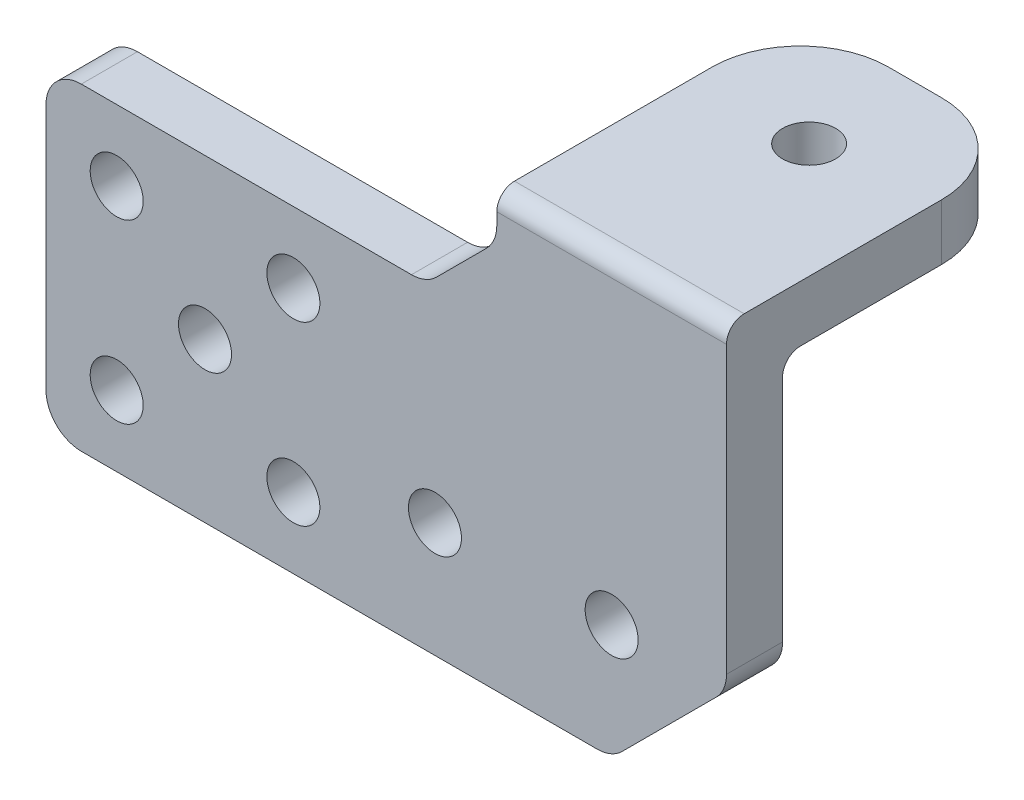
ISO-10303-21;
HEADER;
FILE_DESCRIPTION(('STEP AP214'),'2;1');
FILE_NAME('part.step','',(''),(''),'','','');
FILE_SCHEMA(('AUTOMOTIVE_DESIGN { 1 0 10303 214 1 1 1 1 }'));
ENDSEC;
DATA;
#1=APPLICATION_CONTEXT('core data for automotive mechanical design processes');
#2=APPLICATION_PROTOCOL_DEFINITION('international standard','automotive_design',2000,#1);
#3=PRODUCT_CONTEXT('',#1,'mechanical');
#4=PRODUCT('Part','Part','',(#3));
#5=PRODUCT_RELATED_PRODUCT_CATEGORY('part','',(#4));
#6=PRODUCT_DEFINITION_FORMATION('','',#4);
#7=PRODUCT_DEFINITION_CONTEXT('part definition',#1,'design');
#8=PRODUCT_DEFINITION('design','',#6,#7);
#9=PRODUCT_DEFINITION_SHAPE('','',#8);
#10=(LENGTH_UNIT() NAMED_UNIT(*) SI_UNIT(.MILLI.,.METRE.));
#11=(NAMED_UNIT(*) PLANE_ANGLE_UNIT() SI_UNIT($,.RADIAN.));
#12=(NAMED_UNIT(*) SI_UNIT($,.STERADIAN.) SOLID_ANGLE_UNIT());
#13=UNCERTAINTY_MEASURE_WITH_UNIT(LENGTH_MEASURE(1.E-05),#10,'distance_accuracy_value','');
#14=(GEOMETRIC_REPRESENTATION_CONTEXT(3) GLOBAL_UNCERTAINTY_ASSIGNED_CONTEXT((#13)) GLOBAL_UNIT_ASSIGNED_CONTEXT((#10,
#11,#12)) REPRESENTATION_CONTEXT('',''));
#15=CARTESIAN_POINT('',(0.,0.,0.));
#16=DIRECTION('',(0.,0.,1.));
#17=DIRECTION('',(1.,0.,0.));
#18=AXIS2_PLACEMENT_3D('',#15,#16,#17);
#19=CARTESIAN_POINT('',(6.5,0.,-3.175));
#20=DIRECTION('',(1.,0.,0.));
#21=DIRECTION('',(0.,0.,1.));
#22=AXIS2_PLACEMENT_3D('',#19,#20,#21);
#23=PLANE('',#22);
#24=DIRECTION('',(0.,-1.,0.));
#25=VECTOR('',#24,1.);
#26=CARTESIAN_POINT('',(6.5,0.,-3.175));
#27=LINE('',#26,#25);
#28=CARTESIAN_POINT('',(6.5,13.825,-3.175));
#29=VERTEX_POINT('',#28);
#30=CARTESIAN_POINT('',(6.5,0.82842712474619,-3.175));
#31=VERTEX_POINT('',#30);
#32=EDGE_CURVE('E323',#29,#31,#27,.T.);
#33=ORIENTED_EDGE('',*,*,#32,.F.);
#34=CARTESIAN_POINT('',(6.5,13.825,-4.175));
#35=DIRECTION('',(-1.,0.,0.));
#36=DIRECTION('',(0.,0.,1.));
#37=AXIS2_PLACEMENT_3D('',#34,#35,#36);
#38=CIRCLE('',#37,1.);
#39=CARTESIAN_POINT('',(6.5,14.825,-4.175));
#40=VERTEX_POINT('',#39);
#41=EDGE_CURVE('E230',#40,#29,#38,.F.);
#42=ORIENTED_EDGE('',*,*,#41,.F.);
#43=DIRECTION('',(0.,0.,1.));
#44=VECTOR('',#43,1.);
#45=CARTESIAN_POINT('',(6.5,14.825,-17.175));
#46=LINE('',#45,#44);
#47=CARTESIAN_POINT('',(6.5,14.825,-12.175));
#48=VERTEX_POINT('',#47);
#49=EDGE_CURVE('E357',#48,#40,#46,.T.);
#50=ORIENTED_EDGE('',*,*,#49,.F.);
#51=DIRECTION('',(0.,1.,0.));
#52=VECTOR('',#51,1.);
#53=CARTESIAN_POINT('',(6.5,0.,-12.175));
#54=LINE('',#53,#52);
#55=CARTESIAN_POINT('',(6.5,18.,-12.175));
#56=VERTEX_POINT('',#55);
#57=EDGE_CURVE('E212',#56,#48,#54,.F.);
#58=ORIENTED_EDGE('',*,*,#57,.F.);
#59=DIRECTION('',(0.,0.,1.));
#60=VECTOR('',#59,1.);
#61=CARTESIAN_POINT('',(6.5,18.,-3.175));
#62=LINE('',#61,#60);
#63=CARTESIAN_POINT('',(6.5,18.,-1.));
#64=VERTEX_POINT('',#63);
#65=EDGE_CURVE('E335',#56,#64,#62,.T.);
#66=ORIENTED_EDGE('',*,*,#65,.T.);
#67=CARTESIAN_POINT('',(6.5,17.,-1.));
#68=DIRECTION('',(-1.,0.,0.));
#69=DIRECTION('',(0.,0.,1.));
#70=AXIS2_PLACEMENT_3D('',#67,#68,#69);
#71=CIRCLE('',#70,1.);
#72=CARTESIAN_POINT('',(6.5,17.,0.));
#73=VERTEX_POINT('',#72);
#74=EDGE_CURVE('E217',#73,#64,#71,.T.);
#75=ORIENTED_EDGE('',*,*,#74,.F.);
#76=DIRECTION('',(0.,-1.,0.));
#77=VECTOR('',#76,1.);
#78=CARTESIAN_POINT('',(6.5,0.,0.));
#79=LINE('',#78,#77);
#80=CARTESIAN_POINT('',(6.5,0.82842712474619,0.));
#81=VERTEX_POINT('',#80);
#82=EDGE_CURVE('E344',#73,#81,#79,.T.);
#83=ORIENTED_EDGE('',*,*,#82,.T.);
#84=DIRECTION('',(0.,0.,1.));
#85=VECTOR('',#84,1.);
#86=CARTESIAN_POINT('',(6.5,0.82842712474619,0.));
#87=LINE('',#86,#85);
#88=EDGE_CURVE('E287',#31,#81,#87,.T.);
#89=ORIENTED_EDGE('',*,*,#88,.F.);
#90=EDGE_LOOP('',(#33,#42,#50,#58,#66,#75,#83,#89));
#91=FACE_BOUND('',#90,.T.);
#92=ADVANCED_FACE('F41',(#91),#23,.T.);
#93=CARTESIAN_POINT('',(0.,18.,-3.175));
#94=DIRECTION('',(0.,1.,0.));
#95=DIRECTION('',(0.,0.,-1.));
#96=AXIS2_PLACEMENT_3D('',#93,#94,#95);
#97=PLANE('',#96);
#98=CARTESIAN_POINT('',(0.,18.,-11.175));
#99=DIRECTION('',(0.,-1.,0.));
#100=DIRECTION('',(0.,0.,-1.));
#101=AXIS2_PLACEMENT_3D('',#98,#99,#100);
#102=CIRCLE('',#101,1.5);
#103=CARTESIAN_POINT('',(0.,18.,-12.675));
#104=VERTEX_POINT('',#103);
#105=EDGE_CURVE('E351',#104,#104,#102,.T.);
#106=ORIENTED_EDGE('',*,*,#105,.T.);
#107=EDGE_LOOP('',(#106));
#108=FACE_BOUND('',#107,.T.);
#109=ORIENTED_EDGE('',*,*,#65,.F.);
#110=CARTESIAN_POINT('',(1.5,18.,-12.175));
#111=DIRECTION('',(0.,-1.,0.));
#112=DIRECTION('',(0.,0.,-1.));
#113=AXIS2_PLACEMENT_3D('',#110,#111,#112);
#114=CIRCLE('',#113,5.);
#115=CARTESIAN_POINT('',(1.5,18.,-17.175));
#116=VERTEX_POINT('',#115);
#117=EDGE_CURVE('E206',#116,#56,#114,.T.);
#118=ORIENTED_EDGE('',*,*,#117,.F.);
#119=DIRECTION('',(-1.,0.,0.));
#120=VECTOR('',#119,1.);
#121=CARTESIAN_POINT('',(-6.5,18.,-17.175));
#122=LINE('',#121,#120);
#123=CARTESIAN_POINT('',(-1.5,18.,-17.175));
#124=VERTEX_POINT('',#123);
#125=EDGE_CURVE('E197',#116,#124,#122,.T.);
#126=ORIENTED_EDGE('',*,*,#125,.T.);
#127=CARTESIAN_POINT('',(-1.5,18.,-12.175));
#128=DIRECTION('',(0.,-1.,0.));
#129=DIRECTION('',(0.,0.,-1.));
#130=AXIS2_PLACEMENT_3D('',#127,#128,#129);
#131=CIRCLE('',#130,5.);
#132=CARTESIAN_POINT('',(-6.5,18.,-12.175));
#133=VERTEX_POINT('',#132);
#134=EDGE_CURVE('E185',#133,#124,#131,.T.);
#135=ORIENTED_EDGE('',*,*,#134,.F.);
#136=DIRECTION('',(0.,0.,1.));
#137=VECTOR('',#136,1.);
#138=CARTESIAN_POINT('',(-6.5,18.,-3.175));
#139=LINE('',#138,#137);
#140=CARTESIAN_POINT('',(-6.5,18.,-1.));
#141=VERTEX_POINT('',#140);
#142=EDGE_CURVE('E331',#133,#141,#139,.T.);
#143=ORIENTED_EDGE('',*,*,#142,.T.);
#144=DIRECTION('',(1.,0.,0.));
#145=VECTOR('',#144,1.);
#146=CARTESIAN_POINT('',(-6.5,18.,-1.));
#147=LINE('',#146,#145);
#148=EDGE_CURVE('E220',#64,#141,#147,.F.);
#149=ORIENTED_EDGE('',*,*,#148,.F.);
#150=EDGE_LOOP('',(#109,#118,#126,#135,#143,#149));
#151=FACE_BOUND('',#150,.T.);
#152=ADVANCED_FACE('F359',(#108,#151),#97,.T.);
#153=CARTESIAN_POINT('',(0.,0.,-3.175));
#154=DIRECTION('',(0.,0.,1.));
#155=DIRECTION('',(-1.,0.,0.));
#156=AXIS2_PLACEMENT_3D('',#153,#154,#155);
#157=CYLINDRICAL_SURFACE('',#156,1.5);
#158=CARTESIAN_POINT('',(0.,0.,-3.175));
#159=DIRECTION('',(0.,0.,1.));
#160=DIRECTION('',(1.,0.,0.));
#161=AXIS2_PLACEMENT_3D('',#158,#159,#160);
#162=CIRCLE('',#161,1.5);
#163=CARTESIAN_POINT('',(1.5,0.,-3.175));
#164=VERTEX_POINT('',#163);
#165=EDGE_CURVE('E332',#164,#164,#162,.T.);
#166=ORIENTED_EDGE('',*,*,#165,.F.);
#167=EDGE_LOOP('',(#166));
#168=FACE_BOUND('',#167,.T.);
#169=CARTESIAN_POINT('',(0.,0.,0.));
#170=DIRECTION('',(0.,0.,1.));
#171=DIRECTION('',(1.,0.,0.));
#172=AXIS2_PLACEMENT_3D('',#169,#170,#171);
#173=CIRCLE('',#172,1.5);
#174=CARTESIAN_POINT('',(1.5,0.,0.));
#175=VERTEX_POINT('',#174);
#176=EDGE_CURVE('E341',#175,#175,#173,.T.);
#177=ORIENTED_EDGE('',*,*,#176,.T.);
#178=EDGE_LOOP('',(#177));
#179=FACE_BOUND('',#178,.T.);
#180=ADVANCED_FACE('F450',(#168,#179),#157,.F.);
#181=CARTESIAN_POINT('',(-6.5,0.,-3.175));
#182=DIRECTION('',(-1.,0.,0.));
#183=DIRECTION('',(0.,0.,-1.));
#184=AXIS2_PLACEMENT_3D('',#181,#182,#183);
#185=PLANE('',#184);
#186=DIRECTION('',(0.,1.,0.));
#187=VECTOR('',#186,1.);
#188=CARTESIAN_POINT('',(-6.5,0.,0.));
#189=LINE('',#188,#187);
#190=CARTESIAN_POINT('',(-6.5,16.3284271247462,0.));
#191=VERTEX_POINT('',#190);
#192=CARTESIAN_POINT('',(-6.5,17.,0.));
#193=VERTEX_POINT('',#192);
#194=EDGE_CURVE('E317',#191,#193,#189,.T.);
#195=ORIENTED_EDGE('',*,*,#194,.T.);
#196=CARTESIAN_POINT('',(-6.5,17.,-1.));
#197=DIRECTION('',(1.,0.,0.));
#198=DIRECTION('',(0.,0.,-1.));
#199=AXIS2_PLACEMENT_3D('',#196,#197,#198);
#200=CIRCLE('',#199,1.);
#201=EDGE_CURVE('E223',#141,#193,#200,.T.);
#202=ORIENTED_EDGE('',*,*,#201,.F.);
#203=ORIENTED_EDGE('',*,*,#142,.F.);
#204=DIRECTION('',(0.,-1.,0.));
#205=VECTOR('',#204,1.);
#206=CARTESIAN_POINT('',(-6.5,0.,-12.175));
#207=LINE('',#206,#205);
#208=CARTESIAN_POINT('',(-6.5,14.825,-12.175));
#209=VERTEX_POINT('',#208);
#210=EDGE_CURVE('E204',#209,#133,#207,.F.);
#211=ORIENTED_EDGE('',*,*,#210,.F.);
#212=DIRECTION('',(0.,0.,1.));
#213=VECTOR('',#212,1.);
#214=CARTESIAN_POINT('',(-6.5,14.825,-17.175));
#215=LINE('',#214,#213);
#216=CARTESIAN_POINT('',(-6.5,14.825,-4.175));
#217=VERTEX_POINT('',#216);
#218=EDGE_CURVE('E202',#209,#217,#215,.T.);
#219=ORIENTED_EDGE('',*,*,#218,.T.);
#220=CARTESIAN_POINT('',(-6.5,13.825,-4.175));
#221=DIRECTION('',(1.,0.,0.));
#222=DIRECTION('',(0.,0.,-1.));
#223=AXIS2_PLACEMENT_3D('',#220,#221,#222);
#224=CIRCLE('',#223,1.);
#225=CARTESIAN_POINT('',(-6.5,13.825,-3.175));
#226=VERTEX_POINT('',#225);
#227=EDGE_CURVE('E233',#226,#217,#224,.F.);
#228=ORIENTED_EDGE('',*,*,#227,.F.);
#229=DIRECTION('',(0.,-1.,0.));
#230=VECTOR('',#229,1.);
#231=CARTESIAN_POINT('',(-6.5,0.,-3.175));
#232=LINE('',#231,#230);
#233=CARTESIAN_POINT('',(-6.5,16.3284271247462,-3.175));
#234=VERTEX_POINT('',#233);
#235=EDGE_CURVE('E236',#234,#226,#232,.T.);
#236=ORIENTED_EDGE('',*,*,#235,.F.);
#237=DIRECTION('',(0.,0.,1.));
#238=VECTOR('',#237,1.);
#239=CARTESIAN_POINT('',(-6.5,16.3284271247462,-3.175));
#240=LINE('',#239,#238);
#241=EDGE_CURVE('E271',#191,#234,#240,.F.);
#242=ORIENTED_EDGE('',*,*,#241,.F.);
#243=EDGE_LOOP('',(#195,#202,#203,#211,#219,#228,#236,#242));
#244=FACE_BOUND('',#243,.T.);
#245=ADVANCED_FACE('F319',(#244),#185,.T.);
#246=CARTESIAN_POINT('',(0.,0.,-3.175));
#247=DIRECTION('',(0.,0.,-1.));
#248=DIRECTION('',(1.,0.,0.));
#249=AXIS2_PLACEMENT_3D('',#246,#247,#248);
#250=PLANE('',#249);
#251=DIRECTION('',(-1.,0.,0.));
#252=VECTOR('',#251,1.);
#253=CARTESIAN_POINT('',(0.,-6.5,-3.175));
#254=LINE('',#253,#252);
#255=CARTESIAN_POINT('',(-0.82842712474619,-6.5,-3.175));
#256=VERTEX_POINT('',#255);
#257=CARTESIAN_POINT('',(-30.0129229130922,-6.5,-3.175));
#258=VERTEX_POINT('',#257);
#259=EDGE_CURVE('E367',#256,#258,#254,.T.);
#260=ORIENTED_EDGE('',*,*,#259,.T.);
#261=CARTESIAN_POINT('',(-30.0129229130922,-4.5,-3.175));
#262=DIRECTION('',(0.,0.,1.));
#263=DIRECTION('',(1.,0.,0.));
#264=AXIS2_PLACEMENT_3D('',#261,#262,#263);
#265=CIRCLE('',#264,2.);
#266=CARTESIAN_POINT('',(-32.0129229130922,-4.5,-3.175));
#267=VERTEX_POINT('',#266);
#268=EDGE_CURVE('E260',#267,#258,#265,.T.);
#269=ORIENTED_EDGE('',*,*,#268,.F.);
#270=DIRECTION('',(0.,1.,0.));
#271=VECTOR('',#270,1.);
#272=CARTESIAN_POINT('',(-32.0129229130922,0.,-3.175));
#273=LINE('',#272,#271);
#274=CARTESIAN_POINT('',(-32.0129229130922,9.50000000000003,-3.175));
#275=VERTEX_POINT('',#274);
#276=EDGE_CURVE('E381',#267,#275,#273,.T.);
#277=ORIENTED_EDGE('',*,*,#276,.T.);
#278=CARTESIAN_POINT('',(-30.0129229130922,9.50000000000003,-3.175));
#279=DIRECTION('',(0.,0.,1.));
#280=DIRECTION('',(1.,0.,0.));
#281=AXIS2_PLACEMENT_3D('',#278,#279,#280);
#282=CIRCLE('',#281,2.);
#283=CARTESIAN_POINT('',(-30.0129229130922,11.5,-3.175));
#284=VERTEX_POINT('',#283);
#285=EDGE_CURVE('E257',#284,#275,#282,.T.);
#286=ORIENTED_EDGE('',*,*,#285,.F.);
#287=DIRECTION('',(1.,0.,0.));
#288=VECTOR('',#287,1.);
#289=CARTESIAN_POINT('',(0.,11.5,-3.175));
#290=LINE('',#289,#288);
#291=CARTESIAN_POINT('',(-11.3284271247462,11.5,-3.175));
#292=VERTEX_POINT('',#291);
#293=EDGE_CURVE('E370',#284,#292,#290,.T.);
#294=ORIENTED_EDGE('',*,*,#293,.T.);
#295=CARTESIAN_POINT('',(-11.3284271247462,13.5,-3.175));
#296=DIRECTION('',(0.,0.,1.));
#297=DIRECTION('',(1.,0.,0.));
#298=AXIS2_PLACEMENT_3D('',#295,#296,#297);
#299=CIRCLE('',#298,2.);
#300=CARTESIAN_POINT('',(-9.91421356237311,12.0857864376269,-3.175));
#301=VERTEX_POINT('',#300);
#302=EDGE_CURVE('E292',#301,#292,#299,.F.);
#303=ORIENTED_EDGE('',*,*,#302,.F.);
#304=DIRECTION('',(0.707106781186551,0.707106781186544,0.));
#305=VECTOR('',#304,1.);
#306=CARTESIAN_POINT('',(-10.5,11.5,-3.175));
#307=LINE('',#306,#305);
#308=CARTESIAN_POINT('',(-7.08578643762691,14.9142135623731,-3.175));
#309=VERTEX_POINT('',#308);
#310=EDGE_CURVE('E242',#309,#301,#307,.F.);
#311=ORIENTED_EDGE('',*,*,#310,.F.);
#312=CARTESIAN_POINT('',(-8.5,16.3284271247462,-3.175));
#313=DIRECTION('',(0.,0.,1.));
#314=DIRECTION('',(1.,0.,0.));
#315=AXIS2_PLACEMENT_3D('',#312,#313,#314);
#316=CIRCLE('',#315,2.);
#317=EDGE_CURVE('E49',#234,#309,#316,.F.);
#318=ORIENTED_EDGE('',*,*,#317,.F.);
#319=ORIENTED_EDGE('',*,*,#235,.T.);
#320=DIRECTION('',(1.,0.,0.));
#321=VECTOR('',#320,1.);
#322=CARTESIAN_POINT('',(0.,13.825,-3.175));
#323=LINE('',#322,#321);
#324=EDGE_CURVE('E228',#29,#226,#323,.F.);
#325=ORIENTED_EDGE('',*,*,#324,.F.);
#326=ORIENTED_EDGE('',*,*,#32,.T.);
#327=CARTESIAN_POINT('',(4.5,0.82842712474619,-3.175));
#328=DIRECTION('',(0.,0.,1.));
#329=DIRECTION('',(1.,0.,0.));
#330=AXIS2_PLACEMENT_3D('',#327,#328,#329);
#331=CIRCLE('',#330,2.);
#332=CARTESIAN_POINT('',(5.9142135623731,-0.585786437626904,-3.175));
#333=VERTEX_POINT('',#332);
#334=EDGE_CURVE('E56',#333,#31,#331,.T.);
#335=ORIENTED_EDGE('',*,*,#334,.F.);
#336=DIRECTION('',(-0.707106781186548,-0.707106781186548,0.));
#337=VECTOR('',#336,1.);
#338=CARTESIAN_POINT('',(3.25,-3.25,-3.175));
#339=LINE('',#338,#337);
#340=CARTESIAN_POINT('',(0.585786437626904,-5.9142135623731,-3.175));
#341=VERTEX_POINT('',#340);
#342=EDGE_CURVE('E399',#333,#341,#339,.T.);
#343=ORIENTED_EDGE('',*,*,#342,.T.);
#344=CARTESIAN_POINT('',(-0.82842712474619,-4.5,-3.175));
#345=DIRECTION('',(0.,0.,1.));
#346=DIRECTION('',(1.,0.,0.));
#347=AXIS2_PLACEMENT_3D('',#344,#345,#346);
#348=CIRCLE('',#347,2.);
#349=EDGE_CURVE('E285',#256,#341,#348,.T.);
#350=ORIENTED_EDGE('',*,*,#349,.F.);
#351=EDGE_LOOP('',(#260,#269,#277,#286,#294,#303,#311,#318,#319,#325,#326,#335,#343,#350));
#352=FACE_BOUND('',#351,.T.);
#353=CARTESIAN_POINT('',(-28.0129229130922,7.50000000000006,-3.175));
#354=DIRECTION('',(0.,0.,-1.));
#355=DIRECTION('',(-1.,0.,0.));
#356=AXIS2_PLACEMENT_3D('',#353,#354,#355);
#357=CIRCLE('',#356,1.50000000000011);
#358=CARTESIAN_POINT('',(-29.5129229130923,7.50000000000006,-3.175));
#359=VERTEX_POINT('',#358);
#360=EDGE_CURVE('E398',#359,#359,#357,.T.);
#361=ORIENTED_EDGE('',*,*,#360,.F.);
#362=EDGE_LOOP('',(#361));
#363=FACE_BOUND('',#362,.T.);
#364=CARTESIAN_POINT('',(-28.0129229130922,-2.49999999999994,-3.175));
#365=DIRECTION('',(0.,0.,-1.));
#366=DIRECTION('',(-1.,0.,0.));
#367=AXIS2_PLACEMENT_3D('',#364,#365,#366);
#368=CIRCLE('',#367,1.50000000000011);
#369=CARTESIAN_POINT('',(-29.5129229130923,-2.49999999999994,-3.175));
#370=VERTEX_POINT('',#369);
#371=EDGE_CURVE('E405',#370,#370,#368,.T.);
#372=ORIENTED_EDGE('',*,*,#371,.F.);
#373=EDGE_LOOP('',(#372));
#374=FACE_BOUND('',#373,.T.);
#375=CARTESIAN_POINT('',(-18.0129229130922,-2.49999999999994,-3.175));
#376=DIRECTION('',(0.,0.,-1.));
#377=DIRECTION('',(-1.,0.,0.));
#378=AXIS2_PLACEMENT_3D('',#375,#376,#377);
#379=CIRCLE('',#378,1.5000000000001);
#380=CARTESIAN_POINT('',(-19.5129229130923,-2.49999999999994,-3.175));
#381=VERTEX_POINT('',#380);
#382=EDGE_CURVE('E411',#381,#381,#379,.T.);
#383=ORIENTED_EDGE('',*,*,#382,.F.);
#384=EDGE_LOOP('',(#383));
#385=FACE_BOUND('',#384,.T.);
#386=CARTESIAN_POINT('',(-23.0129229130923,2.50000000000004,-3.175));
#387=DIRECTION('',(0.,0.,-1.));
#388=DIRECTION('',(-1.,0.,0.));
#389=AXIS2_PLACEMENT_3D('',#386,#387,#388);
#390=CIRCLE('',#389,1.5);
#391=CARTESIAN_POINT('',(-24.5129229130923,2.50000000000004,-3.175));
#392=VERTEX_POINT('',#391);
#393=EDGE_CURVE('E392',#392,#392,#390,.T.);
#394=ORIENTED_EDGE('',*,*,#393,.F.);
#395=EDGE_LOOP('',(#394));
#396=FACE_BOUND('',#395,.T.);
#397=CARTESIAN_POINT('',(-18.0129229130922,7.50000000000006,-3.175));
#398=DIRECTION('',(0.,0.,-1.));
#399=DIRECTION('',(-1.,0.,0.));
#400=AXIS2_PLACEMENT_3D('',#397,#398,#399);
#401=CIRCLE('',#400,1.50000000000011);
#402=CARTESIAN_POINT('',(-19.5129229130923,7.50000000000006,-3.175));
#403=VERTEX_POINT('',#402);
#404=EDGE_CURVE('E385',#403,#403,#401,.T.);
#405=ORIENTED_EDGE('',*,*,#404,.F.);
#406=EDGE_LOOP('',(#405));
#407=FACE_BOUND('',#406,.T.);
#408=ORIENTED_EDGE('',*,*,#165,.T.);
#409=EDGE_LOOP('',(#408));
#410=FACE_BOUND('',#409,.T.);
#411=CARTESIAN_POINT('',(-10.,0.,-3.175));
#412=DIRECTION('',(0.,0.,1.));
#413=DIRECTION('',(1.,0.,0.));
#414=AXIS2_PLACEMENT_3D('',#411,#412,#413);
#415=CIRCLE('',#414,1.5);
#416=CARTESIAN_POINT('',(-8.5,0.,-3.175));
#417=VERTEX_POINT('',#416);
#418=EDGE_CURVE('E366',#417,#417,#415,.F.);
#419=ORIENTED_EDGE('',*,*,#418,.F.);
#420=EDGE_LOOP('',(#419));
#421=FACE_BOUND('',#420,.T.);
#422=ADVANCED_FACE('F303',(#352,#363,#374,#385,#396,#407,#410,#421),#250,.T.);
#423=CARTESIAN_POINT('',(0.,0.,0.));
#424=DIRECTION('',(0.,0.,-1.));
#425=DIRECTION('',(1.,0.,0.));
#426=AXIS2_PLACEMENT_3D('',#423,#424,#425);
#427=PLANE('',#426);
#428=CARTESIAN_POINT('',(-28.0129229130922,7.50000000000006,0.));
#429=DIRECTION('',(0.,0.,-1.));
#430=DIRECTION('',(-1.,0.,0.));
#431=AXIS2_PLACEMENT_3D('',#428,#429,#430);
#432=CIRCLE('',#431,1.50000000000011);
#433=CARTESIAN_POINT('',(-29.5129229130923,7.50000000000006,0.));
#434=VERTEX_POINT('',#433);
#435=EDGE_CURVE('E395',#434,#434,#432,.T.);
#436=ORIENTED_EDGE('',*,*,#435,.T.);
#437=EDGE_LOOP('',(#436));
#438=FACE_BOUND('',#437,.T.);
#439=CARTESIAN_POINT('',(-28.0129229130922,-2.49999999999994,0.));
#440=DIRECTION('',(0.,0.,-1.));
#441=DIRECTION('',(-1.,0.,0.));
#442=AXIS2_PLACEMENT_3D('',#439,#440,#441);
#443=CIRCLE('',#442,1.50000000000011);
#444=CARTESIAN_POINT('',(-29.5129229130923,-2.49999999999994,0.));
#445=VERTEX_POINT('',#444);
#446=EDGE_CURVE('E402',#445,#445,#443,.T.);
#447=ORIENTED_EDGE('',*,*,#446,.T.);
#448=EDGE_LOOP('',(#447));
#449=FACE_BOUND('',#448,.T.);
#450=CARTESIAN_POINT('',(-18.0129229130922,-2.49999999999994,0.));
#451=DIRECTION('',(0.,0.,-1.));
#452=DIRECTION('',(-1.,0.,0.));
#453=AXIS2_PLACEMENT_3D('',#450,#451,#452);
#454=CIRCLE('',#453,1.5000000000001);
#455=CARTESIAN_POINT('',(-19.5129229130923,-2.49999999999994,0.));
#456=VERTEX_POINT('',#455);
#457=EDGE_CURVE('E408',#456,#456,#454,.T.);
#458=ORIENTED_EDGE('',*,*,#457,.T.);
#459=EDGE_LOOP('',(#458));
#460=FACE_BOUND('',#459,.T.);
#461=CARTESIAN_POINT('',(-23.0129229130923,2.50000000000004,0.));
#462=DIRECTION('',(0.,0.,-1.));
#463=DIRECTION('',(-1.,0.,0.));
#464=AXIS2_PLACEMENT_3D('',#461,#462,#463);
#465=CIRCLE('',#464,1.5);
#466=CARTESIAN_POINT('',(-24.5129229130923,2.50000000000004,0.));
#467=VERTEX_POINT('',#466);
#468=EDGE_CURVE('E414',#467,#467,#465,.T.);
#469=ORIENTED_EDGE('',*,*,#468,.T.);
#470=EDGE_LOOP('',(#469));
#471=FACE_BOUND('',#470,.T.);
#472=CARTESIAN_POINT('',(-18.0129229130922,7.50000000000006,0.));
#473=DIRECTION('',(0.,0.,-1.));
#474=DIRECTION('',(-1.,0.,0.));
#475=AXIS2_PLACEMENT_3D('',#472,#473,#474);
#476=CIRCLE('',#475,1.50000000000011);
#477=CARTESIAN_POINT('',(-19.5129229130923,7.50000000000006,0.));
#478=VERTEX_POINT('',#477);
#479=EDGE_CURVE('E389',#478,#478,#476,.T.);
#480=ORIENTED_EDGE('',*,*,#479,.T.);
#481=EDGE_LOOP('',(#480));
#482=FACE_BOUND('',#481,.T.);
#483=DIRECTION('',(0.707106781186548,0.707106781186548,0.));
#484=VECTOR('',#483,1.);
#485=CARTESIAN_POINT('',(6.5,0.,0.));
#486=LINE('',#485,#484);
#487=CARTESIAN_POINT('',(0.585786437626904,-5.9142135623731,0.));
#488=VERTEX_POINT('',#487);
#489=CARTESIAN_POINT('',(5.9142135623731,-0.585786437626905,0.));
#490=VERTEX_POINT('',#489);
#491=EDGE_CURVE('E421',#488,#490,#486,.T.);
#492=ORIENTED_EDGE('',*,*,#491,.T.);
#493=CARTESIAN_POINT('',(4.5,0.82842712474619,0.));
#494=DIRECTION('',(0.,0.,1.));
#495=DIRECTION('',(1.,0.,0.));
#496=AXIS2_PLACEMENT_3D('',#493,#494,#495);
#497=CIRCLE('',#496,2.);
#498=EDGE_CURVE('E278',#81,#490,#497,.F.);
#499=ORIENTED_EDGE('',*,*,#498,.F.);
#500=ORIENTED_EDGE('',*,*,#82,.F.);
#501=DIRECTION('',(1.,0.,0.));
#502=VECTOR('',#501,1.);
#503=CARTESIAN_POINT('',(6.5,17.,0.));
#504=LINE('',#503,#502);
#505=EDGE_CURVE('E215',#193,#73,#504,.T.);
#506=ORIENTED_EDGE('',*,*,#505,.F.);
#507=ORIENTED_EDGE('',*,*,#194,.F.);
#508=CARTESIAN_POINT('',(-8.5,16.3284271247462,0.));
#509=DIRECTION('',(0.,0.,1.));
#510=DIRECTION('',(1.,0.,0.));
#511=AXIS2_PLACEMENT_3D('',#508,#509,#510);
#512=CIRCLE('',#511,2.);
#513=CARTESIAN_POINT('',(-7.08578643762691,14.9142135623731,0.));
#514=VERTEX_POINT('',#513);
#515=EDGE_CURVE('E11',#514,#191,#512,.T.);
#516=ORIENTED_EDGE('',*,*,#515,.F.);
#517=DIRECTION('',(-0.707106781186551,-0.707106781186544,0.));
#518=VECTOR('',#517,1.);
#519=CARTESIAN_POINT('',(-11.,11.0000000000001,0.));
#520=LINE('',#519,#518);
#521=CARTESIAN_POINT('',(-9.91421356237312,12.0857864376269,0.));
#522=VERTEX_POINT('',#521);
#523=EDGE_CURVE('E239',#522,#514,#520,.F.);
#524=ORIENTED_EDGE('',*,*,#523,.F.);
#525=CARTESIAN_POINT('',(-11.3284271247462,13.5,0.));
#526=DIRECTION('',(0.,0.,1.));
#527=DIRECTION('',(1.,0.,0.));
#528=AXIS2_PLACEMENT_3D('',#525,#526,#527);
#529=CIRCLE('',#528,2.);
#530=CARTESIAN_POINT('',(-11.3284271247462,11.5,0.));
#531=VERTEX_POINT('',#530);
#532=EDGE_CURVE('E289',#531,#522,#529,.T.);
#533=ORIENTED_EDGE('',*,*,#532,.F.);
#534=DIRECTION('',(1.,0.,0.));
#535=VECTOR('',#534,1.);
#536=CARTESIAN_POINT('',(0.,11.5,0.));
#537=LINE('',#536,#535);
#538=CARTESIAN_POINT('',(-30.0129229130922,11.5,0.));
#539=VERTEX_POINT('',#538);
#540=EDGE_CURVE('E378',#539,#531,#537,.T.);
#541=ORIENTED_EDGE('',*,*,#540,.F.);
#542=CARTESIAN_POINT('',(-30.0129229130922,9.50000000000003,0.));
#543=DIRECTION('',(0.,0.,1.));
#544=DIRECTION('',(1.,0.,0.));
#545=AXIS2_PLACEMENT_3D('',#542,#543,#544);
#546=CIRCLE('',#545,2.);
#547=CARTESIAN_POINT('',(-32.0129229130922,9.50000000000003,0.));
#548=VERTEX_POINT('',#547);
#549=EDGE_CURVE('E247',#548,#539,#546,.F.);
#550=ORIENTED_EDGE('',*,*,#549,.F.);
#551=DIRECTION('',(0.,1.,0.));
#552=VECTOR('',#551,1.);
#553=CARTESIAN_POINT('',(-32.0129229130922,0.,0.));
#554=LINE('',#553,#552);
#555=CARTESIAN_POINT('',(-32.0129229130922,-4.5,0.));
#556=VERTEX_POINT('',#555);
#557=EDGE_CURVE('E382',#556,#548,#554,.T.);
#558=ORIENTED_EDGE('',*,*,#557,.F.);
#559=CARTESIAN_POINT('',(-30.0129229130922,-4.5,0.));
#560=DIRECTION('',(0.,0.,1.));
#561=DIRECTION('',(1.,0.,0.));
#562=AXIS2_PLACEMENT_3D('',#559,#560,#561);
#563=CIRCLE('',#562,2.);
#564=CARTESIAN_POINT('',(-30.0129229130922,-6.5,0.));
#565=VERTEX_POINT('',#564);
#566=EDGE_CURVE('E250',#565,#556,#563,.F.);
#567=ORIENTED_EDGE('',*,*,#566,.F.);
#568=DIRECTION('',(-1.,0.,0.));
#569=VECTOR('',#568,1.);
#570=CARTESIAN_POINT('',(0.,-6.5,0.));
#571=LINE('',#570,#569);
#572=CARTESIAN_POINT('',(-0.82842712474619,-6.5,0.));
#573=VERTEX_POINT('',#572);
#574=EDGE_CURVE('E373',#573,#565,#571,.T.);
#575=ORIENTED_EDGE('',*,*,#574,.F.);
#576=CARTESIAN_POINT('',(-0.82842712474619,-4.5,0.));
#577=DIRECTION('',(0.,0.,1.));
#578=DIRECTION('',(1.,0.,0.));
#579=AXIS2_PLACEMENT_3D('',#576,#577,#578);
#580=CIRCLE('',#579,2.);
#581=EDGE_CURVE('E281',#488,#573,#580,.F.);
#582=ORIENTED_EDGE('',*,*,#581,.F.);
#583=EDGE_LOOP('',(#492,#499,#500,#506,#507,#516,#524,#533,#541,#550,#558,#567,#575,#582));
#584=FACE_BOUND('',#583,.T.);
#585=CARTESIAN_POINT('',(-10.,0.,0.));
#586=DIRECTION('',(0.,0.,-1.));
#587=DIRECTION('',(-1.,0.,0.));
#588=AXIS2_PLACEMENT_3D('',#585,#586,#587);
#589=CIRCLE('',#588,1.5);
#590=CARTESIAN_POINT('',(-11.5,0.,0.));
#591=VERTEX_POINT('',#590);
#592=EDGE_CURVE('E369',#591,#591,#589,.T.);
#593=ORIENTED_EDGE('',*,*,#592,.T.);
#594=EDGE_LOOP('',(#593));
#595=FACE_BOUND('',#594,.T.);
#596=ORIENTED_EDGE('',*,*,#176,.F.);
#597=EDGE_LOOP('',(#596));
#598=FACE_BOUND('',#597,.T.);
#599=ADVANCED_FACE('F314',(#438,#449,#460,#471,#482,#584,#595,#598),#427,.F.);
#600=CARTESIAN_POINT('',(-6.5,14.825,-17.175));
#601=DIRECTION('',(0.,1.,0.));
#602=DIRECTION('',(0.,0.,-1.));
#603=AXIS2_PLACEMENT_3D('',#600,#601,#602);
#604=PLANE('',#603);
#605=CARTESIAN_POINT('',(0.,14.825,-11.175));
#606=DIRECTION('',(0.,-1.,0.));
#607=DIRECTION('',(0.,0.,-1.));
#608=AXIS2_PLACEMENT_3D('',#605,#606,#607);
#609=CIRCLE('',#608,1.5);
#610=CARTESIAN_POINT('',(0.,14.825,-12.675));
#611=VERTEX_POINT('',#610);
#612=EDGE_CURVE('E198',#611,#611,#609,.T.);
#613=ORIENTED_EDGE('',*,*,#612,.F.);
#614=EDGE_LOOP('',(#613));
#615=FACE_BOUND('',#614,.T.);
#616=ORIENTED_EDGE('',*,*,#218,.F.);
#617=CARTESIAN_POINT('',(-1.5,14.825,-12.175));
#618=DIRECTION('',(0.,-1.,0.));
#619=DIRECTION('',(0.,0.,-1.));
#620=AXIS2_PLACEMENT_3D('',#617,#618,#619);
#621=CIRCLE('',#620,5.);
#622=CARTESIAN_POINT('',(-1.5,14.825,-17.175));
#623=VERTEX_POINT('',#622);
#624=EDGE_CURVE('E182',#623,#209,#621,.F.);
#625=ORIENTED_EDGE('',*,*,#624,.F.);
#626=DIRECTION('',(1.,0.,0.));
#627=VECTOR('',#626,1.);
#628=CARTESIAN_POINT('',(-6.5,14.825,-17.175));
#629=LINE('',#628,#627);
#630=CARTESIAN_POINT('',(1.5,14.825,-17.175));
#631=VERTEX_POINT('',#630);
#632=EDGE_CURVE('E193',#623,#631,#629,.T.);
#633=ORIENTED_EDGE('',*,*,#632,.T.);
#634=CARTESIAN_POINT('',(1.5,14.825,-12.175));
#635=DIRECTION('',(0.,-1.,0.));
#636=DIRECTION('',(0.,0.,-1.));
#637=AXIS2_PLACEMENT_3D('',#634,#635,#636);
#638=CIRCLE('',#637,5.);
#639=EDGE_CURVE('E189',#48,#631,#638,.F.);
#640=ORIENTED_EDGE('',*,*,#639,.F.);
#641=ORIENTED_EDGE('',*,*,#49,.T.);
#642=DIRECTION('',(1.,0.,0.));
#643=VECTOR('',#642,1.);
#644=CARTESIAN_POINT('',(-6.5,14.825,-4.175));
#645=LINE('',#644,#643);
#646=EDGE_CURVE('E226',#217,#40,#645,.T.);
#647=ORIENTED_EDGE('',*,*,#646,.F.);
#648=EDGE_LOOP('',(#616,#625,#633,#640,#641,#647));
#649=FACE_BOUND('',#648,.T.);
#650=ADVANCED_FACE('F200',(#615,#649),#604,.F.);
#651=CARTESIAN_POINT('',(0.,0.,-17.175));
#652=DIRECTION('',(0.,0.,-1.));
#653=DIRECTION('',(1.,0.,0.));
#654=AXIS2_PLACEMENT_3D('',#651,#652,#653);
#655=PLANE('',#654);
#656=ORIENTED_EDGE('',*,*,#125,.F.);
#657=DIRECTION('',(0.,1.,0.));
#658=VECTOR('',#657,1.);
#659=CARTESIAN_POINT('',(1.5,0.,-17.175));
#660=LINE('',#659,#658);
#661=EDGE_CURVE('E190',#631,#116,#660,.T.);
#662=ORIENTED_EDGE('',*,*,#661,.F.);
#663=ORIENTED_EDGE('',*,*,#632,.F.);
#664=DIRECTION('',(0.,-1.,0.));
#665=VECTOR('',#664,1.);
#666=CARTESIAN_POINT('',(-1.5,0.,-17.175));
#667=LINE('',#666,#665);
#668=EDGE_CURVE('E178',#124,#623,#667,.T.);
#669=ORIENTED_EDGE('',*,*,#668,.F.);
#670=EDGE_LOOP('',(#656,#662,#663,#669));
#671=FACE_BOUND('',#670,.T.);
#672=ADVANCED_FACE('F194',(#671),#655,.T.);
#673=CARTESIAN_POINT('',(0.,0.,-11.175));
#674=DIRECTION('',(0.,1.,0.));
#675=DIRECTION('',(0.,0.,-1.));
#676=AXIS2_PLACEMENT_3D('',#673,#674,#675);
#677=CYLINDRICAL_SURFACE('',#676,1.5);
#678=ORIENTED_EDGE('',*,*,#105,.F.);
#679=EDGE_LOOP('',(#678));
#680=FACE_BOUND('',#679,.T.);
#681=ORIENTED_EDGE('',*,*,#612,.T.);
#682=EDGE_LOOP('',(#681));
#683=FACE_BOUND('',#682,.T.);
#684=ADVANCED_FACE('F459',(#680,#683),#677,.F.);
#685=CARTESIAN_POINT('',(-1.5,0.,-12.175));
#686=DIRECTION('',(0.,-1.,0.));
#687=DIRECTION('',(0.,0.,1.));
#688=AXIS2_PLACEMENT_3D('',#685,#686,#687);
#689=CYLINDRICAL_SURFACE('',#688,5.);
#690=ORIENTED_EDGE('',*,*,#134,.T.);
#691=ORIENTED_EDGE('',*,*,#668,.T.);
#692=ORIENTED_EDGE('',*,*,#624,.T.);
#693=ORIENTED_EDGE('',*,*,#210,.T.);
#694=EDGE_LOOP('',(#690,#691,#692,#693));
#695=FACE_BOUND('',#694,.T.);
#696=ADVANCED_FACE('F180',(#695),#689,.T.);
#697=CARTESIAN_POINT('',(1.5,0.,-12.175));
#698=DIRECTION('',(0.,1.,0.));
#699=DIRECTION('',(0.,0.,-1.));
#700=AXIS2_PLACEMENT_3D('',#697,#698,#699);
#701=CYLINDRICAL_SURFACE('',#700,5.);
#702=ORIENTED_EDGE('',*,*,#639,.T.);
#703=ORIENTED_EDGE('',*,*,#661,.T.);
#704=ORIENTED_EDGE('',*,*,#117,.T.);
#705=ORIENTED_EDGE('',*,*,#57,.T.);
#706=EDGE_LOOP('',(#702,#703,#704,#705));
#707=FACE_BOUND('',#706,.T.);
#708=ADVANCED_FACE('F353',(#707),#701,.T.);
#709=CARTESIAN_POINT('',(0.,-6.5,-24.1809515376));
#710=DIRECTION('',(0.,-1.,0.));
#711=DIRECTION('',(0.,0.,1.));
#712=AXIS2_PLACEMENT_3D('',#709,#710,#711);
#713=PLANE('',#712);
#714=ORIENTED_EDGE('',*,*,#574,.T.);
#715=DIRECTION('',(0.,0.,1.));
#716=VECTOR('',#715,1.);
#717=CARTESIAN_POINT('',(-30.0129229130922,-6.5,-24.1809515376));
#718=LINE('',#717,#716);
#719=EDGE_CURVE('E245',#258,#565,#718,.T.);
#720=ORIENTED_EDGE('',*,*,#719,.F.);
#721=ORIENTED_EDGE('',*,*,#259,.F.);
#722=DIRECTION('',(0.,0.,1.));
#723=VECTOR('',#722,1.);
#724=CARTESIAN_POINT('',(-0.82842712474619,-6.5,-3.175));
#725=LINE('',#724,#723);
#726=EDGE_CURVE('E64',#573,#256,#725,.F.);
#727=ORIENTED_EDGE('',*,*,#726,.F.);
#728=EDGE_LOOP('',(#714,#720,#721,#727));
#729=FACE_BOUND('',#728,.T.);
#730=ADVANCED_FACE('F441',(#729),#713,.T.);
#731=CARTESIAN_POINT('',(-10.,0.,-24.1809515376));
#732=DIRECTION('',(0.,0.,1.));
#733=DIRECTION('',(-1.,0.,0.));
#734=AXIS2_PLACEMENT_3D('',#731,#732,#733);
#735=CYLINDRICAL_SURFACE('',#734,1.5);
#736=ORIENTED_EDGE('',*,*,#592,.F.);
#737=EDGE_LOOP('',(#736));
#738=FACE_BOUND('',#737,.T.);
#739=ORIENTED_EDGE('',*,*,#418,.T.);
#740=EDGE_LOOP('',(#739));
#741=FACE_BOUND('',#740,.T.);
#742=ADVANCED_FACE('F433',(#738,#741),#735,.F.);
#743=CARTESIAN_POINT('',(0.,17.,-1.));
#744=DIRECTION('',(-1.,0.,0.));
#745=DIRECTION('',(0.,0.,-1.));
#746=AXIS2_PLACEMENT_3D('',#743,#744,#745);
#747=CYLINDRICAL_SURFACE('',#746,1.);
#748=ORIENTED_EDGE('',*,*,#201,.T.);
#749=ORIENTED_EDGE('',*,*,#505,.T.);
#750=ORIENTED_EDGE('',*,*,#74,.T.);
#751=ORIENTED_EDGE('',*,*,#148,.T.);
#752=EDGE_LOOP('',(#748,#749,#750,#751));
#753=FACE_BOUND('',#752,.T.);
#754=ADVANCED_FACE('F430',(#753),#747,.T.);
#755=CARTESIAN_POINT('',(-6.5,13.825,-4.175));
#756=DIRECTION('',(1.,0.,0.));
#757=DIRECTION('',(0.,0.,1.));
#758=AXIS2_PLACEMENT_3D('',#755,#756,#757);
#759=CYLINDRICAL_SURFACE('',#758,1.);
#760=ORIENTED_EDGE('',*,*,#227,.T.);
#761=ORIENTED_EDGE('',*,*,#646,.T.);
#762=ORIENTED_EDGE('',*,*,#41,.T.);
#763=ORIENTED_EDGE('',*,*,#324,.T.);
#764=EDGE_LOOP('',(#760,#761,#762,#763));
#765=FACE_BOUND('',#764,.T.);
#766=ADVANCED_FACE('F326',(#765),#759,.F.);
#767=CARTESIAN_POINT('',(0.,11.5,-3.175));
#768=DIRECTION('',(0.,1.,0.));
#769=DIRECTION('',(0.,0.,-1.));
#770=AXIS2_PLACEMENT_3D('',#767,#768,#769);
#771=PLANE('',#770);
#772=ORIENTED_EDGE('',*,*,#293,.F.);
#773=DIRECTION('',(0.,0.,1.));
#774=VECTOR('',#773,1.);
#775=CARTESIAN_POINT('',(-30.0129229130922,11.5,-3.175));
#776=LINE('',#775,#774);
#777=EDGE_CURVE('E263',#539,#284,#776,.F.);
#778=ORIENTED_EDGE('',*,*,#777,.F.);
#779=ORIENTED_EDGE('',*,*,#540,.T.);
#780=DIRECTION('',(0.,0.,-1.));
#781=VECTOR('',#780,1.);
#782=CARTESIAN_POINT('',(-11.3284271247462,11.5,-3.175));
#783=LINE('',#782,#781);
#784=EDGE_CURVE('E265',#292,#531,#783,.F.);
#785=ORIENTED_EDGE('',*,*,#784,.F.);
#786=EDGE_LOOP('',(#772,#778,#779,#785));
#787=FACE_BOUND('',#786,.T.);
#788=ADVANCED_FACE('F439',(#787),#771,.T.);
#789=CARTESIAN_POINT('',(-32.0129229130922,0.,-3.175));
#790=DIRECTION('',(-1.,0.,0.));
#791=DIRECTION('',(0.,0.,-1.));
#792=AXIS2_PLACEMENT_3D('',#789,#790,#791);
#793=PLANE('',#792);
#794=ORIENTED_EDGE('',*,*,#557,.T.);
#795=DIRECTION('',(0.,0.,1.));
#796=VECTOR('',#795,1.);
#797=CARTESIAN_POINT('',(-32.0129229130922,9.50000000000003,-3.175));
#798=LINE('',#797,#796);
#799=EDGE_CURVE('E253',#275,#548,#798,.T.);
#800=ORIENTED_EDGE('',*,*,#799,.F.);
#801=ORIENTED_EDGE('',*,*,#276,.F.);
#802=DIRECTION('',(0.,0.,1.));
#803=VECTOR('',#802,1.);
#804=CARTESIAN_POINT('',(-32.0129229130922,-4.5,-3.175));
#805=LINE('',#804,#803);
#806=EDGE_CURVE('E255',#556,#267,#805,.F.);
#807=ORIENTED_EDGE('',*,*,#806,.F.);
#808=EDGE_LOOP('',(#794,#800,#801,#807));
#809=FACE_BOUND('',#808,.T.);
#810=ADVANCED_FACE('F469',(#809),#793,.T.);
#811=CARTESIAN_POINT('',(-18.0129229130922,7.50000000000006,-3.175));
#812=DIRECTION('',(0.,0.,1.));
#813=DIRECTION('',(-1.,0.,0.));
#814=AXIS2_PLACEMENT_3D('',#811,#812,#813);
#815=CYLINDRICAL_SURFACE('',#814,1.50000000000011);
#816=ORIENTED_EDGE('',*,*,#404,.T.);
#817=EDGE_LOOP('',(#816));
#818=FACE_BOUND('',#817,.T.);
#819=ORIENTED_EDGE('',*,*,#479,.F.);
#820=EDGE_LOOP('',(#819));
#821=FACE_BOUND('',#820,.T.);
#822=ADVANCED_FACE('F557',(#818,#821),#815,.F.);
#823=CARTESIAN_POINT('',(-23.0129229130923,2.50000000000004,-3.175));
#824=DIRECTION('',(0.,0.,1.));
#825=DIRECTION('',(-1.,0.,0.));
#826=AXIS2_PLACEMENT_3D('',#823,#824,#825);
#827=CYLINDRICAL_SURFACE('',#826,1.5);
#828=ORIENTED_EDGE('',*,*,#393,.T.);
#829=EDGE_LOOP('',(#828));
#830=FACE_BOUND('',#829,.T.);
#831=ORIENTED_EDGE('',*,*,#468,.F.);
#832=EDGE_LOOP('',(#831));
#833=FACE_BOUND('',#832,.T.);
#834=ADVANCED_FACE('F566',(#830,#833),#827,.F.);
#835=CARTESIAN_POINT('',(-18.0129229130922,-2.49999999999994,-3.175));
#836=DIRECTION('',(0.,0.,1.));
#837=DIRECTION('',(-1.,0.,0.));
#838=AXIS2_PLACEMENT_3D('',#835,#836,#837);
#839=CYLINDRICAL_SURFACE('',#838,1.5000000000001);
#840=ORIENTED_EDGE('',*,*,#382,.T.);
#841=EDGE_LOOP('',(#840));
#842=FACE_BOUND('',#841,.T.);
#843=ORIENTED_EDGE('',*,*,#457,.F.);
#844=EDGE_LOOP('',(#843));
#845=FACE_BOUND('',#844,.T.);
#846=ADVANCED_FACE('F576',(#842,#845),#839,.F.);
#847=CARTESIAN_POINT('',(-28.0129229130922,-2.49999999999994,-3.175));
#848=DIRECTION('',(0.,0.,1.));
#849=DIRECTION('',(-1.,0.,0.));
#850=AXIS2_PLACEMENT_3D('',#847,#848,#849);
#851=CYLINDRICAL_SURFACE('',#850,1.50000000000011);
#852=ORIENTED_EDGE('',*,*,#371,.T.);
#853=EDGE_LOOP('',(#852));
#854=FACE_BOUND('',#853,.T.);
#855=ORIENTED_EDGE('',*,*,#446,.F.);
#856=EDGE_LOOP('',(#855));
#857=FACE_BOUND('',#856,.T.);
#858=ADVANCED_FACE('F586',(#854,#857),#851,.F.);
#859=CARTESIAN_POINT('',(-28.0129229130922,7.50000000000006,-3.175));
#860=DIRECTION('',(0.,0.,1.));
#861=DIRECTION('',(-1.,0.,0.));
#862=AXIS2_PLACEMENT_3D('',#859,#860,#861);
#863=CYLINDRICAL_SURFACE('',#862,1.50000000000011);
#864=ORIENTED_EDGE('',*,*,#360,.T.);
#865=EDGE_LOOP('',(#864));
#866=FACE_BOUND('',#865,.T.);
#867=ORIENTED_EDGE('',*,*,#435,.F.);
#868=EDGE_LOOP('',(#867));
#869=FACE_BOUND('',#868,.T.);
#870=ADVANCED_FACE('F596',(#866,#869),#863,.F.);
#871=CARTESIAN_POINT('',(-10.5,11.5,-3.175));
#872=DIRECTION('',(-0.707106781186544,0.707106781186551,0.));
#873=DIRECTION('',(0.,0.,-1.));
#874=AXIS2_PLACEMENT_3D('',#871,#872,#873);
#875=PLANE('',#874);
#876=ORIENTED_EDGE('',*,*,#523,.T.);
#877=DIRECTION('',(0.,0.,-1.));
#878=VECTOR('',#877,1.);
#879=CARTESIAN_POINT('',(-7.08578643762691,14.9142135623731,-3.175));
#880=LINE('',#879,#878);
#881=EDGE_CURVE('E267',#309,#514,#880,.F.);
#882=ORIENTED_EDGE('',*,*,#881,.F.);
#883=ORIENTED_EDGE('',*,*,#310,.T.);
#884=DIRECTION('',(0.,0.,1.));
#885=VECTOR('',#884,1.);
#886=CARTESIAN_POINT('',(-9.91421356237311,12.0857864376269,-3.175));
#887=LINE('',#886,#885);
#888=EDGE_CURVE('E269',#522,#301,#887,.F.);
#889=ORIENTED_EDGE('',*,*,#888,.F.);
#890=EDGE_LOOP('',(#876,#882,#883,#889));
#891=FACE_BOUND('',#890,.T.);
#892=ADVANCED_FACE('F307',(#891),#875,.T.);
#893=CARTESIAN_POINT('',(-30.0129229130922,-4.5,-24.1809515376));
#894=DIRECTION('',(0.,0.,1.));
#895=DIRECTION('',(-1.,0.,0.));
#896=AXIS2_PLACEMENT_3D('',#893,#894,#895);
#897=CYLINDRICAL_SURFACE('',#896,2.);
#898=ORIENTED_EDGE('',*,*,#268,.T.);
#899=ORIENTED_EDGE('',*,*,#719,.T.);
#900=ORIENTED_EDGE('',*,*,#566,.T.);
#901=ORIENTED_EDGE('',*,*,#806,.T.);
#902=EDGE_LOOP('',(#898,#899,#900,#901));
#903=FACE_BOUND('',#902,.T.);
#904=ADVANCED_FACE('F615',(#903),#897,.T.);
#905=CARTESIAN_POINT('',(-30.0129229130922,9.50000000000003,-3.175));
#906=DIRECTION('',(0.,0.,1.));
#907=DIRECTION('',(-1.,0.,0.));
#908=AXIS2_PLACEMENT_3D('',#905,#906,#907);
#909=CYLINDRICAL_SURFACE('',#908,2.);
#910=ORIENTED_EDGE('',*,*,#285,.T.);
#911=ORIENTED_EDGE('',*,*,#799,.T.);
#912=ORIENTED_EDGE('',*,*,#549,.T.);
#913=ORIENTED_EDGE('',*,*,#777,.T.);
#914=EDGE_LOOP('',(#910,#911,#912,#913));
#915=FACE_BOUND('',#914,.T.);
#916=ADVANCED_FACE('F624',(#915),#909,.T.);
#917=CARTESIAN_POINT('',(6.5,0.,-10.));
#918=DIRECTION('',(-0.707106781186548,0.707106781186548,0.));
#919=DIRECTION('',(-0.707106781186548,-0.707106781186548,0.));
#920=AXIS2_PLACEMENT_3D('',#917,#918,#919);
#921=PLANE('',#920);
#922=ORIENTED_EDGE('',*,*,#342,.F.);
#923=DIRECTION('',(0.,0.,1.));
#924=VECTOR('',#923,1.);
#925=CARTESIAN_POINT('',(5.9142135623731,-0.585786437626905,-3.175));
#926=LINE('',#925,#924);
#927=EDGE_CURVE('E274',#490,#333,#926,.F.);
#928=ORIENTED_EDGE('',*,*,#927,.F.);
#929=ORIENTED_EDGE('',*,*,#491,.F.);
#930=DIRECTION('',(0.,0.,1.));
#931=VECTOR('',#930,1.);
#932=CARTESIAN_POINT('',(0.585786437626905,-5.9142135623731,0.));
#933=LINE('',#932,#931);
#934=EDGE_CURVE('E276',#341,#488,#933,.T.);
#935=ORIENTED_EDGE('',*,*,#934,.F.);
#936=EDGE_LOOP('',(#922,#928,#929,#935));
#937=FACE_BOUND('',#936,.T.);
#938=ADVANCED_FACE('F428',(#937),#921,.F.);
#939=CARTESIAN_POINT('',(-11.3284271247462,13.5,-3.175));
#940=DIRECTION('',(0.,0.,-1.));
#941=DIRECTION('',(1.,0.,0.));
#942=AXIS2_PLACEMENT_3D('',#939,#940,#941);
#943=CYLINDRICAL_SURFACE('',#942,2.);
#944=ORIENTED_EDGE('',*,*,#302,.T.);
#945=ORIENTED_EDGE('',*,*,#784,.T.);
#946=ORIENTED_EDGE('',*,*,#532,.T.);
#947=ORIENTED_EDGE('',*,*,#888,.T.);
#948=EDGE_LOOP('',(#944,#945,#946,#947));
#949=FACE_BOUND('',#948,.T.);
#950=ADVANCED_FACE('F643',(#949),#943,.F.);
#951=CARTESIAN_POINT('',(-8.5,16.3284271247462,-3.175));
#952=DIRECTION('',(0.,0.,1.));
#953=DIRECTION('',(-1.,0.,0.));
#954=AXIS2_PLACEMENT_3D('',#951,#952,#953);
#955=CYLINDRICAL_SURFACE('',#954,2.);
#956=ORIENTED_EDGE('',*,*,#515,.T.);
#957=ORIENTED_EDGE('',*,*,#241,.T.);
#958=ORIENTED_EDGE('',*,*,#317,.T.);
#959=ORIENTED_EDGE('',*,*,#881,.T.);
#960=EDGE_LOOP('',(#956,#957,#958,#959));
#961=FACE_BOUND('',#960,.T.);
#962=ADVANCED_FACE('F297',(#961),#955,.F.);
#963=CARTESIAN_POINT('',(-0.82842712474619,-4.5,-10.));
#964=DIRECTION('',(0.,0.,-1.));
#965=DIRECTION('',(1.,0.,0.));
#966=AXIS2_PLACEMENT_3D('',#963,#964,#965);
#967=CYLINDRICAL_SURFACE('',#966,2.);
#968=ORIENTED_EDGE('',*,*,#349,.T.);
#969=ORIENTED_EDGE('',*,*,#934,.T.);
#970=ORIENTED_EDGE('',*,*,#581,.T.);
#971=ORIENTED_EDGE('',*,*,#726,.T.);
#972=EDGE_LOOP('',(#968,#969,#970,#971));
#973=FACE_BOUND('',#972,.T.);
#974=ADVANCED_FACE('F661',(#973),#967,.T.);
#975=CARTESIAN_POINT('',(4.5,0.82842712474619,-3.175));
#976=DIRECTION('',(0.,0.,-1.));
#977=DIRECTION('',(1.,0.,0.));
#978=AXIS2_PLACEMENT_3D('',#975,#976,#977);
#979=CYLINDRICAL_SURFACE('',#978,2.);
#980=ORIENTED_EDGE('',*,*,#334,.T.);
#981=ORIENTED_EDGE('',*,*,#88,.T.);
#982=ORIENTED_EDGE('',*,*,#498,.T.);
#983=ORIENTED_EDGE('',*,*,#927,.T.);
#984=EDGE_LOOP('',(#980,#981,#982,#983));
#985=FACE_BOUND('',#984,.T.);
#986=ADVANCED_FACE('F43',(#985),#979,.T.);
#987=CLOSED_SHELL('',(#92,#152,#180,#245,#422,#599,#650,#672,#684,#696,#708,#730,#742,#754,#766,
#788,#810,#822,#834,#846,#858,#870,#892,#904,#916,#938,#950,#962,#974,#986));
#988=MANIFOLD_SOLID_BREP('B2',#987);
#989=ADVANCED_BREP_SHAPE_REPRESENTATION('',(#18,#988),#14);
#990=SHAPE_DEFINITION_REPRESENTATION(#9,#989);
ENDSEC;
END-ISO-10303-21;
